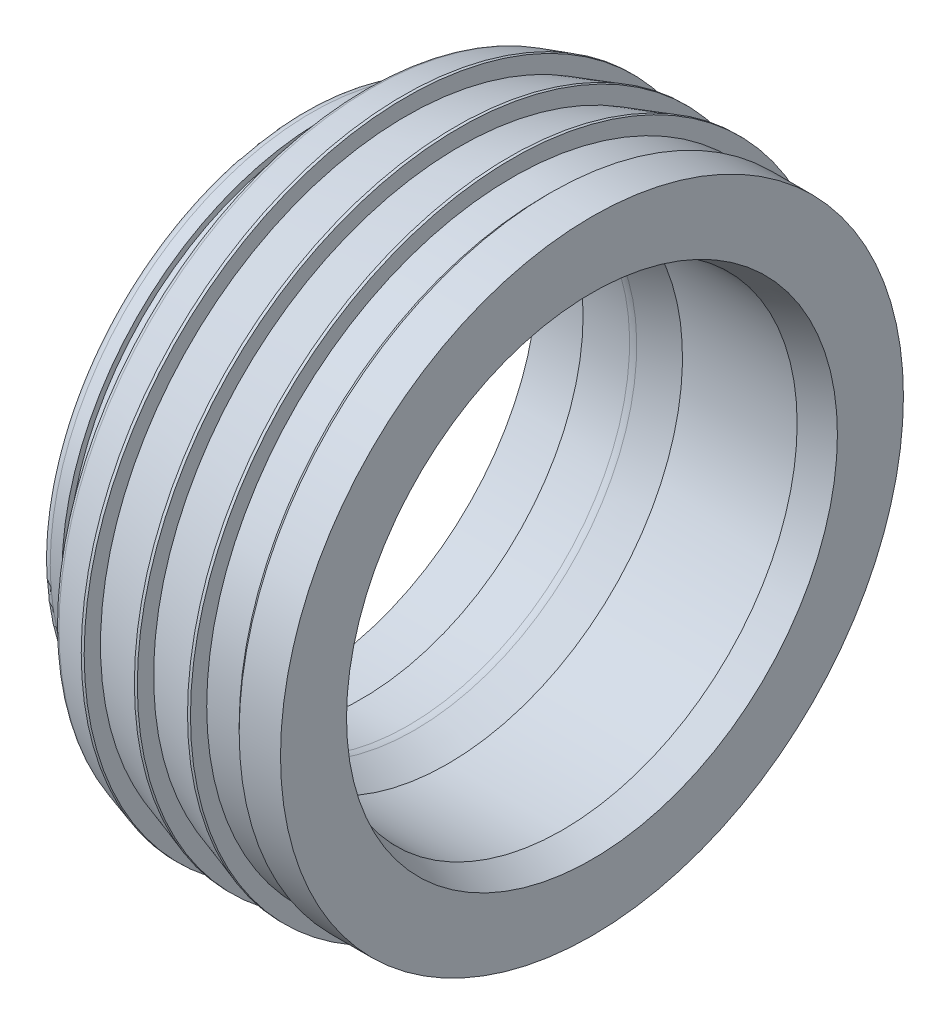
ISO-10303-21;
HEADER;
FILE_DESCRIPTION(('STEP AP214'),'2;1');
FILE_NAME('part.step','',(''),(''),'','','');
FILE_SCHEMA(('AUTOMOTIVE_DESIGN { 1 0 10303 214 1 1 1 1 }'));
ENDSEC;
DATA;
#1=APPLICATION_CONTEXT('core data for automotive mechanical design processes');
#2=APPLICATION_PROTOCOL_DEFINITION('international standard','automotive_design',2000,#1);
#3=PRODUCT_CONTEXT('',#1,'mechanical');
#4=PRODUCT('Part','Part','',(#3));
#5=PRODUCT_RELATED_PRODUCT_CATEGORY('part','',(#4));
#6=PRODUCT_DEFINITION_FORMATION('','',#4);
#7=PRODUCT_DEFINITION_CONTEXT('part definition',#1,'design');
#8=PRODUCT_DEFINITION('design','',#6,#7);
#9=PRODUCT_DEFINITION_SHAPE('','',#8);
#10=(LENGTH_UNIT() NAMED_UNIT(*) SI_UNIT(.MILLI.,.METRE.));
#11=(NAMED_UNIT(*) PLANE_ANGLE_UNIT() SI_UNIT($,.RADIAN.));
#12=(NAMED_UNIT(*) SI_UNIT($,.STERADIAN.) SOLID_ANGLE_UNIT());
#13=UNCERTAINTY_MEASURE_WITH_UNIT(LENGTH_MEASURE(1.E-05),#10,'distance_accuracy_value','');
#14=(GEOMETRIC_REPRESENTATION_CONTEXT(3) GLOBAL_UNCERTAINTY_ASSIGNED_CONTEXT((#13)) GLOBAL_UNIT_ASSIGNED_CONTEXT((#10,
#11,#12)) REPRESENTATION_CONTEXT('',''));
#15=CARTESIAN_POINT('',(0.,0.,0.));
#16=DIRECTION('',(0.,0.,1.));
#17=DIRECTION('',(1.,0.,0.));
#18=AXIS2_PLACEMENT_3D('',#15,#16,#17);
#19=CARTESIAN_POINT('',(0.,0.,0.));
#20=DIRECTION('',(1.,0.,0.));
#21=DIRECTION('',(0.,0.,-1.));
#22=AXIS2_PLACEMENT_3D('',#19,#20,#21);
#23=PLANE('',#22);
#24=CARTESIAN_POINT('',(0.,0.,0.));
#25=DIRECTION('',(-1.,0.,0.));
#26=DIRECTION('',(0.,1.,0.));
#27=AXIS2_PLACEMENT_3D('',#24,#25,#26);
#28=CIRCLE('',#27,4.475);
#29=CARTESIAN_POINT('',(0.,4.475,0.));
#30=VERTEX_POINT('',#29);
#31=EDGE_CURVE('E116',#30,#30,#28,.F.);
#32=ORIENTED_EDGE('',*,*,#31,.T.);
#33=EDGE_LOOP('',(#32));
#34=FACE_BOUND('',#33,.T.);
#35=CARTESIAN_POINT('',(0.,0.,0.));
#36=DIRECTION('',(1.,0.,0.));
#37=DIRECTION('',(0.,1.,0.));
#38=AXIS2_PLACEMENT_3D('',#35,#36,#37);
#39=CIRCLE('',#38,5.139213801822);
#40=CARTESIAN_POINT('',(0.,5.139213801822,0.));
#41=VERTEX_POINT('',#40);
#42=EDGE_CURVE('E113',#41,#41,#39,.T.);
#43=ORIENTED_EDGE('',*,*,#42,.F.);
#44=EDGE_LOOP('',(#43));
#45=FACE_BOUND('',#44,.T.);
#46=ADVANCED_FACE('F14',(#34,#45),#23,.F.);
#47=CARTESIAN_POINT('',(0.15,0.,0.));
#48=DIRECTION('',(1.,0.,0.));
#49=DIRECTION('',(0.,-1.,0.));
#50=AXIS2_PLACEMENT_3D('',#47,#48,#49);
#51=TOROIDAL_SURFACE('',#50,5.139213801822,0.15);
#52=CARTESIAN_POINT('',(0.105887122629156,0.,0.));
#53=DIRECTION('',(1.,0.,0.));
#54=DIRECTION('',(0.,-1.,0.));
#55=AXIS2_PLACEMENT_3D('',#52,#53,#54);
#56=CIRCLE('',#55,5.28258065313025);
#57=CARTESIAN_POINT('',(0.105887122629156,-5.28258065313025,0.));
#58=VERTEX_POINT('',#57);
#59=EDGE_CURVE('E79',#58,#58,#56,.T.);
#60=ORIENTED_EDGE('',*,*,#59,.F.);
#61=EDGE_LOOP('',(#60));
#62=FACE_BOUND('',#61,.T.);
#63=ORIENTED_EDGE('',*,*,#42,.T.);
#64=EDGE_LOOP('',(#63));
#65=FACE_BOUND('',#64,.T.);
#66=ADVANCED_FACE('F95',(#62,#65),#51,.T.);
#67=CARTESIAN_POINT('',(-0.15,0.,0.));
#68=DIRECTION('',(1.,0.,0.));
#69=DIRECTION('',(0.,-1.,0.));
#70=AXIS2_PLACEMENT_3D('',#67,#68,#69);
#71=TOROIDAL_SURFACE('',#70,4.475,0.15);
#72=ORIENTED_EDGE('',*,*,#31,.F.);
#73=EDGE_LOOP('',(#72));
#74=FACE_BOUND('',#73,.T.);
#75=CARTESIAN_POINT('',(-0.15,0.,0.));
#76=DIRECTION('',(-1.,0.,0.));
#77=DIRECTION('',(0.,0.,1.));
#78=AXIS2_PLACEMENT_3D('',#75,#76,#77);
#79=CIRCLE('',#78,4.325);
#80=CARTESIAN_POINT('',(-0.15,0.,4.325));
#81=VERTEX_POINT('',#80);
#82=EDGE_CURVE('E74',#81,#81,#79,.T.);
#83=ORIENTED_EDGE('',*,*,#82,.F.);
#84=EDGE_LOOP('',(#83));
#85=FACE_BOUND('',#84,.T.);
#86=ADVANCED_FACE('F90',(#74,#85),#71,.F.);
#87=CARTESIAN_POINT('',(0.650000000007367,0.,0.));
#88=DIRECTION('',(1.,0.,0.));
#89=DIRECTION('',(0.,0.,-1.));
#90=AXIS2_PLACEMENT_3D('',#87,#88,#89);
#91=CONICAL_SURFACE('',#90,5.4500000000246,0.298498931600862);
#92=CARTESIAN_POINT('',(0.65,0.,0.));
#93=DIRECTION('',(-1.,0.,0.));
#94=DIRECTION('',(0.,0.,1.));
#95=AXIS2_PLACEMENT_3D('',#92,#93,#94);
#96=CIRCLE('',#95,5.45);
#97=CARTESIAN_POINT('',(0.65,0.,5.45));
#98=VERTEX_POINT('',#97);
#99=EDGE_CURVE('E70',#98,#98,#96,.F.);
#100=ORIENTED_EDGE('',*,*,#99,.F.);
#101=EDGE_LOOP('',(#100));
#102=FACE_BOUND('',#101,.T.);
#103=ORIENTED_EDGE('',*,*,#59,.T.);
#104=EDGE_LOOP('',(#103));
#105=FACE_BOUND('',#104,.T.);
#106=ADVANCED_FACE('F94',(#102,#105),#91,.T.);
#107=CARTESIAN_POINT('',(-1.295,0.,0.));
#108=DIRECTION('',(-1.,0.,0.));
#109=DIRECTION('',(0.,0.,1.));
#110=AXIS2_PLACEMENT_3D('',#107,#108,#109);
#111=CYLINDRICAL_SURFACE('',#110,4.325);
#112=ORIENTED_EDGE('',*,*,#82,.T.);
#113=EDGE_LOOP('',(#112));
#114=FACE_BOUND('',#113,.T.);
#115=CARTESIAN_POINT('',(-0.7,0.,0.));
#116=DIRECTION('',(-1.,0.,0.));
#117=DIRECTION('',(0.,0.,1.));
#118=AXIS2_PLACEMENT_3D('',#115,#116,#117);
#119=CIRCLE('',#118,4.325);
#120=CARTESIAN_POINT('',(-0.7,0.,4.325));
#121=VERTEX_POINT('',#120);
#122=EDGE_CURVE('E18',#121,#121,#119,.T.);
#123=ORIENTED_EDGE('',*,*,#122,.F.);
#124=EDGE_LOOP('',(#123));
#125=FACE_BOUND('',#124,.T.);
#126=ADVANCED_FACE('F256',(#114,#125),#111,.T.);
#127=CARTESIAN_POINT('',(-1.295,0.,0.));
#128=DIRECTION('',(-1.,0.,0.));
#129=DIRECTION('',(0.,0.,1.));
#130=AXIS2_PLACEMENT_3D('',#127,#128,#129);
#131=CYLINDRICAL_SURFACE('',#130,5.45);
#132=CARTESIAN_POINT('',(0.7,0.,0.));
#133=DIRECTION('',(-1.,0.,0.));
#134=DIRECTION('',(0.,0.,1.));
#135=AXIS2_PLACEMENT_3D('',#132,#133,#134);
#136=CIRCLE('',#135,5.45);
#137=CARTESIAN_POINT('',(0.7,0.,5.45));
#138=VERTEX_POINT('',#137);
#139=EDGE_CURVE('E65',#138,#138,#136,.F.);
#140=ORIENTED_EDGE('',*,*,#139,.F.);
#141=EDGE_LOOP('',(#140));
#142=FACE_BOUND('',#141,.T.);
#143=ORIENTED_EDGE('',*,*,#99,.T.);
#144=EDGE_LOOP('',(#143));
#145=FACE_BOUND('',#144,.T.);
#146=ADVANCED_FACE('F254',(#142,#145),#131,.T.);
#147=CARTESIAN_POINT('',(-0.7,0.,0.));
#148=DIRECTION('',(1.,0.,0.));
#149=DIRECTION('',(0.,0.,-1.));
#150=AXIS2_PLACEMENT_3D('',#147,#148,#149);
#151=PLANE('',#150);
#152=ORIENTED_EDGE('',*,*,#122,.T.);
#153=EDGE_LOOP('',(#152));
#154=FACE_BOUND('',#153,.T.);
#155=CARTESIAN_POINT('',(-0.7,0.,0.));
#156=DIRECTION('',(-1.,0.,0.));
#157=DIRECTION('',(0.,0.,1.));
#158=AXIS2_PLACEMENT_3D('',#155,#156,#157);
#159=CIRCLE('',#158,4.425);
#160=CARTESIAN_POINT('',(-0.7,0.,4.425));
#161=VERTEX_POINT('',#160);
#162=EDGE_CURVE('E63',#161,#161,#159,.T.);
#163=ORIENTED_EDGE('',*,*,#162,.F.);
#164=EDGE_LOOP('',(#163));
#165=FACE_BOUND('',#164,.T.);
#166=ADVANCED_FACE('F248',(#154,#165),#151,.T.);
#167=CARTESIAN_POINT('',(0.7,0.,0.));
#168=DIRECTION('',(1.,0.,0.));
#169=DIRECTION('',(0.,0.,-1.));
#170=AXIS2_PLACEMENT_3D('',#167,#168,#169);
#171=PLANE('',#170);
#172=CARTESIAN_POINT('',(0.699999999994816,0.,0.));
#173=DIRECTION('',(1.,0.,0.));
#174=DIRECTION('',(0.,0.,-1.));
#175=AXIS2_PLACEMENT_3D('',#172,#173,#174);
#176=CIRCLE('',#175,5.17381825815733);
#177=CARTESIAN_POINT('',(0.699999999994816,0.,-5.17381825815733));
#178=VERTEX_POINT('',#177);
#179=EDGE_CURVE('E59',#178,#178,#176,.T.);
#180=ORIENTED_EDGE('',*,*,#179,.F.);
#181=EDGE_LOOP('',(#180));
#182=FACE_BOUND('',#181,.T.);
#183=ORIENTED_EDGE('',*,*,#139,.T.);
#184=EDGE_LOOP('',(#183));
#185=FACE_BOUND('',#184,.T.);
#186=ADVANCED_FACE('F241',(#182,#185),#171,.T.);
#187=CARTESIAN_POINT('',(-1.295,0.,0.));
#188=DIRECTION('',(-1.,0.,0.));
#189=DIRECTION('',(0.,0.,1.));
#190=AXIS2_PLACEMENT_3D('',#187,#188,#189);
#191=CYLINDRICAL_SURFACE('',#190,4.425);
#192=ORIENTED_EDGE('',*,*,#162,.T.);
#193=EDGE_LOOP('',(#192));
#194=FACE_BOUND('',#193,.T.);
#195=CARTESIAN_POINT('',(-0.9,0.,0.));
#196=DIRECTION('',(1.,0.,0.));
#197=DIRECTION('',(0.,-1.,0.));
#198=AXIS2_PLACEMENT_3D('',#195,#196,#197);
#199=CIRCLE('',#198,4.425);
#200=CARTESIAN_POINT('',(-0.9,-4.425,0.));
#201=VERTEX_POINT('',#200);
#202=EDGE_CURVE('E62',#201,#201,#199,.F.);
#203=ORIENTED_EDGE('',*,*,#202,.F.);
#204=EDGE_LOOP('',(#203));
#205=FACE_BOUND('',#204,.T.);
#206=ADVANCED_FACE('F239',(#194,#205),#191,.T.);
#207=CARTESIAN_POINT('',(1.55000000000882,0.,0.));
#208=DIRECTION('',(1.,0.,0.));
#209=DIRECTION('',(0.,0.,-1.));
#210=AXIS2_PLACEMENT_3D('',#207,#208,#209);
#211=CONICAL_SURFACE('',#210,5.44999999996776,0.314159265367398);
#212=CARTESIAN_POINT('',(1.55,0.,0.));
#213=DIRECTION('',(-1.,0.,0.));
#214=DIRECTION('',(0.,0.,1.));
#215=AXIS2_PLACEMENT_3D('',#212,#213,#214);
#216=CIRCLE('',#215,5.45);
#217=CARTESIAN_POINT('',(1.55,0.,5.45));
#218=VERTEX_POINT('',#217);
#219=EDGE_CURVE('E228',#218,#218,#216,.F.);
#220=ORIENTED_EDGE('',*,*,#219,.F.);
#221=EDGE_LOOP('',(#220));
#222=FACE_BOUND('',#221,.T.);
#223=ORIENTED_EDGE('',*,*,#179,.T.);
#224=EDGE_LOOP('',(#223));
#225=FACE_BOUND('',#224,.T.);
#226=ADVANCED_FACE('F221',(#222,#225),#211,.T.);
#227=CARTESIAN_POINT('',(-0.9,0.,0.));
#228=DIRECTION('',(1.,0.,0.));
#229=DIRECTION('',(0.,-1.,0.));
#230=AXIS2_PLACEMENT_3D('',#227,#228,#229);
#231=TOROIDAL_SURFACE('',#230,4.275,0.15);
#232=ORIENTED_EDGE('',*,*,#202,.T.);
#233=EDGE_LOOP('',(#232));
#234=FACE_BOUND('',#233,.T.);
#235=CARTESIAN_POINT('',(-1.05,0.,0.));
#236=DIRECTION('',(1.,0.,0.));
#237=DIRECTION('',(0.,-1.,0.));
#238=AXIS2_PLACEMENT_3D('',#235,#236,#237);
#239=CIRCLE('',#238,4.275);
#240=CARTESIAN_POINT('',(-1.05,-4.275,0.));
#241=VERTEX_POINT('',#240);
#242=EDGE_CURVE('E58',#241,#241,#239,.T.);
#243=ORIENTED_EDGE('',*,*,#242,.T.);
#244=EDGE_LOOP('',(#243));
#245=FACE_BOUND('',#244,.T.);
#246=ADVANCED_FACE('F216',(#234,#245),#231,.T.);
#247=CARTESIAN_POINT('',(-1.295,0.,0.));
#248=DIRECTION('',(-1.,0.,0.));
#249=DIRECTION('',(0.,0.,1.));
#250=AXIS2_PLACEMENT_3D('',#247,#248,#249);
#251=CYLINDRICAL_SURFACE('',#250,5.45);
#252=CARTESIAN_POINT('',(1.6,0.,0.));
#253=DIRECTION('',(-1.,0.,0.));
#254=DIRECTION('',(0.,0.,1.));
#255=AXIS2_PLACEMENT_3D('',#252,#253,#254);
#256=CIRCLE('',#255,5.45);
#257=CARTESIAN_POINT('',(1.6,0.,5.45));
#258=VERTEX_POINT('',#257);
#259=EDGE_CURVE('E55',#258,#258,#256,.F.);
#260=ORIENTED_EDGE('',*,*,#259,.F.);
#261=EDGE_LOOP('',(#260));
#262=FACE_BOUND('',#261,.T.);
#263=ORIENTED_EDGE('',*,*,#219,.T.);
#264=EDGE_LOOP('',(#263));
#265=FACE_BOUND('',#264,.T.);
#266=ADVANCED_FACE('F211',(#262,#265),#251,.T.);
#267=CARTESIAN_POINT('',(-1.05,0.,0.));
#268=DIRECTION('',(1.,0.,0.));
#269=DIRECTION('',(0.,0.,-1.));
#270=AXIS2_PLACEMENT_3D('',#267,#268,#269);
#271=PLANE('',#270);
#272=CARTESIAN_POINT('',(-1.05,0.,0.));
#273=DIRECTION('',(-1.,0.,0.));
#274=DIRECTION('',(0.,0.,1.));
#275=AXIS2_PLACEMENT_3D('',#272,#273,#274);
#276=CIRCLE('',#275,3.975);
#277=CARTESIAN_POINT('',(-1.05,0.,3.975));
#278=VERTEX_POINT('',#277);
#279=EDGE_CURVE('E52',#278,#278,#276,.F.);
#280=ORIENTED_EDGE('',*,*,#279,.T.);
#281=EDGE_LOOP('',(#280));
#282=FACE_BOUND('',#281,.T.);
#283=ORIENTED_EDGE('',*,*,#242,.F.);
#284=EDGE_LOOP('',(#283));
#285=FACE_BOUND('',#284,.T.);
#286=ADVANCED_FACE('F200',(#282,#285),#271,.F.);
#287=CARTESIAN_POINT('',(1.6,0.,0.));
#288=DIRECTION('',(1.,0.,0.));
#289=DIRECTION('',(0.,0.,-1.));
#290=AXIS2_PLACEMENT_3D('',#287,#288,#289);
#291=PLANE('',#290);
#292=CARTESIAN_POINT('',(1.59999999999627,0.,0.));
#293=DIRECTION('',(1.,0.,0.));
#294=DIRECTION('',(0.,0.,-1.));
#295=AXIS2_PLACEMENT_3D('',#292,#293,#294);
#296=CIRCLE('',#295,5.17381825818575);
#297=CARTESIAN_POINT('',(1.59999999999627,0.,-5.17381825818575));
#298=VERTEX_POINT('',#297);
#299=EDGE_CURVE('E49',#298,#298,#296,.T.);
#300=ORIENTED_EDGE('',*,*,#299,.F.);
#301=EDGE_LOOP('',(#300));
#302=FACE_BOUND('',#301,.T.);
#303=ORIENTED_EDGE('',*,*,#259,.T.);
#304=EDGE_LOOP('',(#303));
#305=FACE_BOUND('',#304,.T.);
#306=ADVANCED_FACE('F210',(#302,#305),#291,.T.);
#307=CARTESIAN_POINT('',(-1.295,0.,0.));
#308=DIRECTION('',(-1.,0.,0.));
#309=DIRECTION('',(0.,0.,1.));
#310=AXIS2_PLACEMENT_3D('',#307,#308,#309);
#311=CYLINDRICAL_SURFACE('',#310,3.975);
#312=CARTESIAN_POINT('',(-0.0500000000000001,0.,0.));
#313=DIRECTION('',(-1.,0.,0.));
#314=DIRECTION('',(0.,0.,1.));
#315=AXIS2_PLACEMENT_3D('',#312,#313,#314);
#316=CIRCLE('',#315,3.975);
#317=CARTESIAN_POINT('',(-0.0500000000000001,0.,3.975));
#318=VERTEX_POINT('',#317);
#319=EDGE_CURVE('E46',#318,#318,#316,.F.);
#320=ORIENTED_EDGE('',*,*,#319,.T.);
#321=EDGE_LOOP('',(#320));
#322=FACE_BOUND('',#321,.T.);
#323=ORIENTED_EDGE('',*,*,#279,.F.);
#324=EDGE_LOOP('',(#323));
#325=FACE_BOUND('',#324,.T.);
#326=ADVANCED_FACE('F365',(#322,#325),#311,.F.);
#327=CARTESIAN_POINT('',(2.45000000001028,0.,0.));
#328=DIRECTION('',(1.,0.,0.));
#329=DIRECTION('',(0.,0.,-1.));
#330=AXIS2_PLACEMENT_3D('',#327,#328,#329);
#331=CONICAL_SURFACE('',#330,5.44999999999618,0.314159265367398);
#332=CARTESIAN_POINT('',(2.45,0.,0.));
#333=DIRECTION('',(-1.,0.,0.));
#334=DIRECTION('',(0.,0.,1.));
#335=AXIS2_PLACEMENT_3D('',#332,#333,#334);
#336=CIRCLE('',#335,5.45);
#337=CARTESIAN_POINT('',(2.45,0.,5.45));
#338=VERTEX_POINT('',#337);
#339=EDGE_CURVE('E45',#338,#338,#336,.F.);
#340=ORIENTED_EDGE('',*,*,#339,.F.);
#341=EDGE_LOOP('',(#340));
#342=FACE_BOUND('',#341,.T.);
#343=ORIENTED_EDGE('',*,*,#299,.T.);
#344=EDGE_LOOP('',(#343));
#345=FACE_BOUND('',#344,.T.);
#346=ADVANCED_FACE('F374',(#342,#345),#331,.T.);
#347=CARTESIAN_POINT('',(-0.05,0.,0.));
#348=DIRECTION('',(1.,0.,0.));
#349=DIRECTION('',(0.,0.,-1.));
#350=AXIS2_PLACEMENT_3D('',#347,#348,#349);
#351=PLANE('',#350);
#352=CARTESIAN_POINT('',(-0.0499999999999999,0.,0.));
#353=DIRECTION('',(-1.,0.,0.));
#354=DIRECTION('',(0.,0.,1.));
#355=AXIS2_PLACEMENT_3D('',#352,#353,#354);
#356=CIRCLE('',#355,3.75);
#357=CARTESIAN_POINT('',(-0.0499999999999999,0.,3.75));
#358=VERTEX_POINT('',#357);
#359=EDGE_CURVE('E42',#358,#358,#356,.F.);
#360=ORIENTED_EDGE('',*,*,#359,.T.);
#361=EDGE_LOOP('',(#360));
#362=FACE_BOUND('',#361,.T.);
#363=ORIENTED_EDGE('',*,*,#319,.F.);
#364=EDGE_LOOP('',(#363));
#365=FACE_BOUND('',#364,.T.);
#366=ADVANCED_FACE('F383',(#362,#365),#351,.F.);
#367=CARTESIAN_POINT('',(-1.295,0.,0.));
#368=DIRECTION('',(-1.,0.,0.));
#369=DIRECTION('',(0.,0.,1.));
#370=AXIS2_PLACEMENT_3D('',#367,#368,#369);
#371=CYLINDRICAL_SURFACE('',#370,5.45);
#372=CARTESIAN_POINT('',(2.5,0.,0.));
#373=DIRECTION('',(-1.,0.,0.));
#374=DIRECTION('',(0.,0.,1.));
#375=AXIS2_PLACEMENT_3D('',#372,#373,#374);
#376=CIRCLE('',#375,5.45);
#377=CARTESIAN_POINT('',(2.5,0.,5.45));
#378=VERTEX_POINT('',#377);
#379=EDGE_CURVE('E39',#378,#378,#376,.F.);
#380=ORIENTED_EDGE('',*,*,#379,.F.);
#381=EDGE_LOOP('',(#380));
#382=FACE_BOUND('',#381,.T.);
#383=ORIENTED_EDGE('',*,*,#339,.T.);
#384=EDGE_LOOP('',(#383));
#385=FACE_BOUND('',#384,.T.);
#386=ADVANCED_FACE('F393',(#382,#385),#371,.T.);
#387=CARTESIAN_POINT('',(-1.295,0.,0.));
#388=DIRECTION('',(-1.,0.,0.));
#389=DIRECTION('',(0.,0.,1.));
#390=AXIS2_PLACEMENT_3D('',#387,#388,#389);
#391=CYLINDRICAL_SURFACE('',#390,3.75);
#392=ORIENTED_EDGE('',*,*,#359,.F.);
#393=EDGE_LOOP('',(#392));
#394=FACE_BOUND('',#393,.T.);
#395=CARTESIAN_POINT('',(0.7371019057875,0.,0.));
#396=DIRECTION('',(1.,0.,0.));
#397=DIRECTION('',(0.,-1.,0.));
#398=AXIS2_PLACEMENT_3D('',#395,#396,#397);
#399=CIRCLE('',#398,3.75);
#400=CARTESIAN_POINT('',(0.7371019057875,-3.75,0.));
#401=VERTEX_POINT('',#400);
#402=EDGE_CURVE('E38',#401,#401,#399,.F.);
#403=ORIENTED_EDGE('',*,*,#402,.F.);
#404=EDGE_LOOP('',(#403));
#405=FACE_BOUND('',#404,.T.);
#406=ADVANCED_FACE('F403',(#394,#405),#391,.F.);
#407=CARTESIAN_POINT('',(2.5,0.,0.));
#408=DIRECTION('',(1.,0.,0.));
#409=DIRECTION('',(0.,0.,-1.));
#410=AXIS2_PLACEMENT_3D('',#407,#408,#409);
#411=PLANE('',#410);
#412=CARTESIAN_POINT('',(2.5,0.,0.));
#413=DIRECTION('',(-1.,0.,0.));
#414=DIRECTION('',(0.,0.,1.));
#415=AXIS2_PLACEMENT_3D('',#412,#413,#414);
#416=CIRCLE('',#415,5.175);
#417=CARTESIAN_POINT('',(2.5,0.,5.175));
#418=VERTEX_POINT('',#417);
#419=EDGE_CURVE('E34',#418,#418,#416,.F.);
#420=ORIENTED_EDGE('',*,*,#419,.F.);
#421=EDGE_LOOP('',(#420));
#422=FACE_BOUND('',#421,.T.);
#423=ORIENTED_EDGE('',*,*,#379,.T.);
#424=EDGE_LOOP('',(#423));
#425=FACE_BOUND('',#424,.T.);
#426=ADVANCED_FACE('F179',(#422,#425),#411,.T.);
#427=CARTESIAN_POINT('',(0.7371019057875,0.,0.));
#428=DIRECTION('',(1.,0.,0.));
#429=DIRECTION('',(0.,-1.,0.));
#430=AXIS2_PLACEMENT_3D('',#427,#428,#429);
#431=TOROIDAL_SURFACE('',#430,4.05,0.3);
#432=ORIENTED_EDGE('',*,*,#402,.T.);
#433=EDGE_LOOP('',(#432));
#434=FACE_BOUND('',#433,.T.);
#435=CARTESIAN_POINT('',(0.839707948784962,0.,0.));
#436=DIRECTION('',(1.,0.,0.));
#437=DIRECTION('',(0.,-1.,0.));
#438=AXIS2_PLACEMENT_3D('',#435,#436,#437);
#439=CIRCLE('',#438,3.76809221378949);
#440=CARTESIAN_POINT('',(0.839707948784962,-3.76809221378949,0.));
#441=VERTEX_POINT('',#440);
#442=EDGE_CURVE('E37',#441,#441,#439,.T.);
#443=ORIENTED_EDGE('',*,*,#442,.T.);
#444=EDGE_LOOP('',(#443));
#445=FACE_BOUND('',#444,.T.);
#446=ADVANCED_FACE('F174',(#434,#445),#431,.T.);
#447=CARTESIAN_POINT('',(-1.295,0.,0.));
#448=DIRECTION('',(-1.,0.,0.));
#449=DIRECTION('',(0.,0.,1.));
#450=AXIS2_PLACEMENT_3D('',#447,#448,#449);
#451=CYLINDRICAL_SURFACE('',#450,5.175);
#452=CARTESIAN_POINT('',(3.05000000008704,0.,0.));
#453=DIRECTION('',(1.,0.,0.));
#454=DIRECTION('',(0.,-1.,0.));
#455=AXIS2_PLACEMENT_3D('',#452,#453,#454);
#456=CIRCLE('',#455,5.17500000000837);
#457=CARTESIAN_POINT('',(3.05000000008704,-5.17500000000837,0.));
#458=VERTEX_POINT('',#457);
#459=EDGE_CURVE('E535',#458,#458,#456,.T.);
#460=ORIENTED_EDGE('',*,*,#459,.F.);
#461=EDGE_LOOP('',(#460));
#462=FACE_BOUND('',#461,.T.);
#463=ORIENTED_EDGE('',*,*,#419,.T.);
#464=EDGE_LOOP('',(#463));
#465=FACE_BOUND('',#464,.T.);
#466=ADVANCED_FACE('F170',(#462,#465),#451,.T.);
#467=CARTESIAN_POINT('',(1.40818241936813,0.,0.));
#468=DIRECTION('',(1.,0.,0.));
#469=DIRECTION('',(0.,0.,-1.));
#470=AXIS2_PLACEMENT_3D('',#467,#468,#469);
#471=CONICAL_SURFACE('',#470,3.97500000002537,0.349065850404111);
#472=ORIENTED_EDGE('',*,*,#442,.F.);
#473=EDGE_LOOP('',(#472));
#474=FACE_BOUND('',#473,.T.);
#475=CARTESIAN_POINT('',(1.408182419377,0.,0.));
#476=DIRECTION('',(-1.,0.,0.));
#477=DIRECTION('',(0.,0.,1.));
#478=AXIS2_PLACEMENT_3D('',#475,#476,#477);
#479=CIRCLE('',#478,3.975);
#480=CARTESIAN_POINT('',(1.408182419377,0.,3.975));
#481=VERTEX_POINT('',#480);
#482=EDGE_CURVE('E537',#481,#481,#479,.F.);
#483=ORIENTED_EDGE('',*,*,#482,.T.);
#484=EDGE_LOOP('',(#483));
#485=FACE_BOUND('',#484,.T.);
#486=ADVANCED_FACE('F166',(#474,#485),#471,.F.);
#487=CARTESIAN_POINT('',(3.15000000000509,0.,0.));
#488=DIRECTION('',(1.,0.,0.));
#489=DIRECTION('',(0.,0.,-1.));
#490=AXIS2_PLACEMENT_3D('',#487,#488,#489);
#491=CONICAL_SURFACE('',#490,5.27499999992642,0.785398163397448);
#492=CARTESIAN_POINT('',(3.15,0.,0.));
#493=DIRECTION('',(-1.,0.,0.));
#494=DIRECTION('',(0.,0.,1.));
#495=AXIS2_PLACEMENT_3D('',#492,#493,#494);
#496=CIRCLE('',#495,5.275);
#497=CARTESIAN_POINT('',(3.15,0.,5.275));
#498=VERTEX_POINT('',#497);
#499=EDGE_CURVE('E541',#498,#498,#496,.F.);
#500=ORIENTED_EDGE('',*,*,#499,.F.);
#501=EDGE_LOOP('',(#500));
#502=FACE_BOUND('',#501,.T.);
#503=ORIENTED_EDGE('',*,*,#459,.T.);
#504=EDGE_LOOP('',(#503));
#505=FACE_BOUND('',#504,.T.);
#506=ADVANCED_FACE('F162',(#502,#505),#491,.T.);
#507=CARTESIAN_POINT('',(-1.295,0.,0.));
#508=DIRECTION('',(-1.,0.,0.));
#509=DIRECTION('',(0.,0.,1.));
#510=AXIS2_PLACEMENT_3D('',#507,#508,#509);
#511=CYLINDRICAL_SURFACE('',#510,3.975);
#512=ORIENTED_EDGE('',*,*,#482,.F.);
#513=EDGE_LOOP('',(#512));
#514=FACE_BOUND('',#513,.T.);
#515=CARTESIAN_POINT('',(3.35000000001173,0.,0.));
#516=DIRECTION('',(1.,0.,0.));
#517=DIRECTION('',(0.,-1.,0.));
#518=AXIS2_PLACEMENT_3D('',#515,#516,#517);
#519=CIRCLE('',#518,3.97500000002537);
#520=CARTESIAN_POINT('',(3.35000000001173,-3.97500000002537,0.));
#521=VERTEX_POINT('',#520);
#522=EDGE_CURVE('E27',#521,#521,#519,.T.);
#523=ORIENTED_EDGE('',*,*,#522,.T.);
#524=EDGE_LOOP('',(#523));
#525=FACE_BOUND('',#524,.T.);
#526=ADVANCED_FACE('F158',(#514,#525),#511,.F.);
#527=CARTESIAN_POINT('',(-1.295,0.,0.));
#528=DIRECTION('',(-1.,0.,0.));
#529=DIRECTION('',(0.,0.,1.));
#530=AXIS2_PLACEMENT_3D('',#527,#528,#529);
#531=CYLINDRICAL_SURFACE('',#530,5.275);
#532=CARTESIAN_POINT('',(3.85,0.,0.));
#533=DIRECTION('',(-1.,0.,0.));
#534=DIRECTION('',(0.,0.,1.));
#535=AXIS2_PLACEMENT_3D('',#532,#533,#534);
#536=CIRCLE('',#535,5.275);
#537=CARTESIAN_POINT('',(3.85,0.,5.275));
#538=VERTEX_POINT('',#537);
#539=EDGE_CURVE('E22',#538,#538,#536,.F.);
#540=ORIENTED_EDGE('',*,*,#539,.F.);
#541=EDGE_LOOP('',(#540));
#542=FACE_BOUND('',#541,.T.);
#543=ORIENTED_EDGE('',*,*,#499,.T.);
#544=EDGE_LOOP('',(#543));
#545=FACE_BOUND('',#544,.T.);
#546=ADVANCED_FACE('F151',(#542,#545),#531,.T.);
#547=CARTESIAN_POINT('',(3.84999999982938,0.,0.));
#548=DIRECTION('',(1.,0.,0.));
#549=DIRECTION('',(0.,0.,-1.));
#550=AXIS2_PLACEMENT_3D('',#547,#548,#549);
#551=CONICAL_SURFACE('',#550,4.15698511710616,0.349065850451);
#552=ORIENTED_EDGE('',*,*,#522,.F.);
#553=EDGE_LOOP('',(#552));
#554=FACE_BOUND('',#553,.T.);
#555=CARTESIAN_POINT('',(3.84999999994307,0.,0.));
#556=DIRECTION('',(1.,0.,0.));
#557=DIRECTION('',(0.,0.,-1.));
#558=AXIS2_PLACEMENT_3D('',#555,#556,#557);
#559=CIRCLE('',#558,4.15698511714754);
#560=CARTESIAN_POINT('',(3.84999999994307,0.,-4.15698511714754));
#561=VERTEX_POINT('',#560);
#562=EDGE_CURVE('E10',#561,#561,#559,.F.);
#563=ORIENTED_EDGE('',*,*,#562,.F.);
#564=EDGE_LOOP('',(#563));
#565=FACE_BOUND('',#564,.T.);
#566=ADVANCED_FACE('F146',(#554,#565),#551,.F.);
#567=CARTESIAN_POINT('',(3.85,0.,0.));
#568=DIRECTION('',(1.,0.,0.));
#569=DIRECTION('',(0.,0.,-1.));
#570=AXIS2_PLACEMENT_3D('',#567,#568,#569);
#571=PLANE('',#570);
#572=ORIENTED_EDGE('',*,*,#562,.T.);
#573=EDGE_LOOP('',(#572));
#574=FACE_BOUND('',#573,.T.);
#575=ORIENTED_EDGE('',*,*,#539,.T.);
#576=EDGE_LOOP('',(#575));
#577=FACE_BOUND('',#576,.T.);
#578=ADVANCED_FACE('F144',(#574,#577),#571,.T.);
#579=CLOSED_SHELL('',(#46,#66,#86,#106,#126,#146,#166,#186,#206,#226,#246,#266,#286,#306,#326,
#346,#366,#386,#406,#426,#446,#466,#486,#506,#526,#546,#566,#578));
#580=MANIFOLD_SOLID_BREP('B1',#579);
#581=ADVANCED_BREP_SHAPE_REPRESENTATION('',(#18,#580),#14);
#582=SHAPE_DEFINITION_REPRESENTATION(#9,#581);
ENDSEC;
END-ISO-10303-21;
